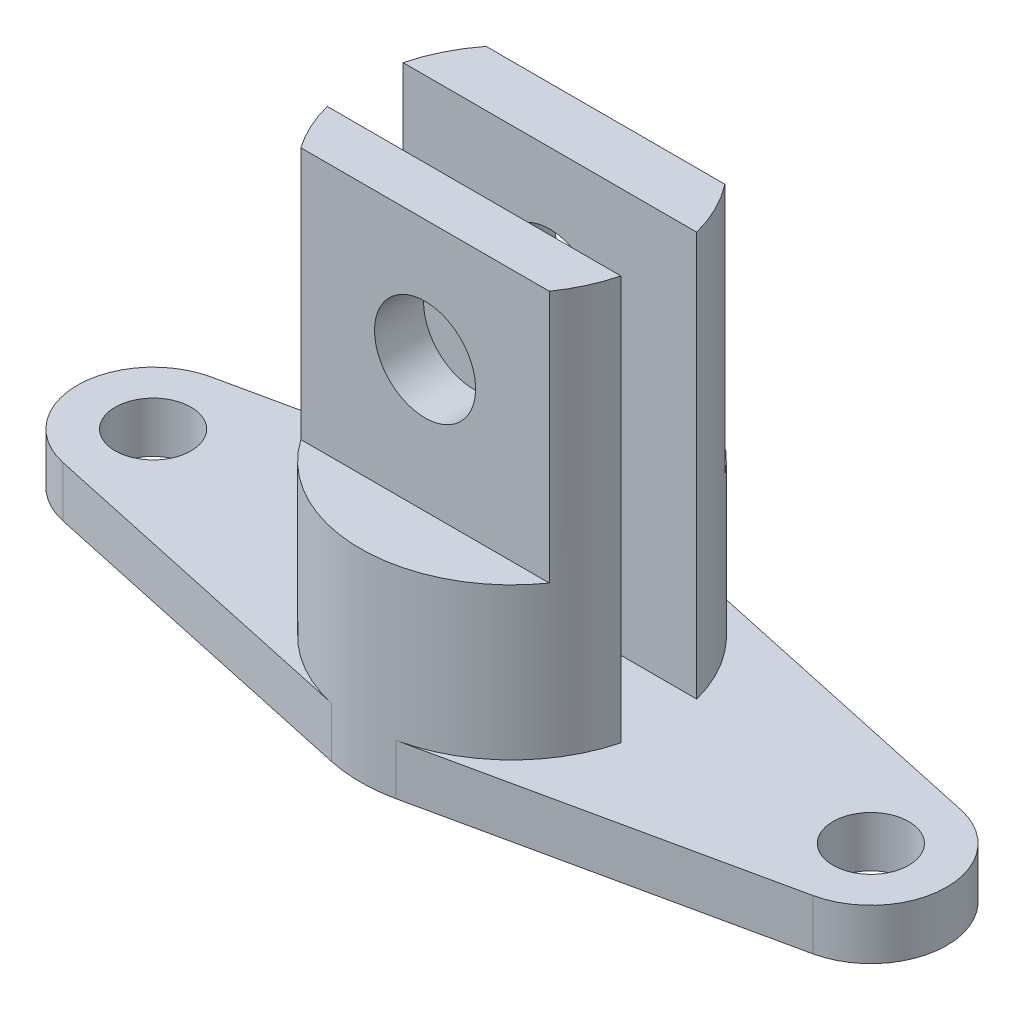
ISO-10303-21;
HEADER;
FILE_DESCRIPTION(('STEP AP214'),'2;1');
FILE_NAME('part.step','',(''),(''),'','','');
FILE_SCHEMA(('AUTOMOTIVE_DESIGN { 1 0 10303 214 1 1 1 1 }'));
ENDSEC;
DATA;
#1=APPLICATION_CONTEXT('core data for automotive mechanical design processes');
#2=APPLICATION_PROTOCOL_DEFINITION('international standard','automotive_design',2000,#1);
#3=PRODUCT_CONTEXT('',#1,'mechanical');
#4=PRODUCT('Part','Part','',(#3));
#5=PRODUCT_RELATED_PRODUCT_CATEGORY('part','',(#4));
#6=PRODUCT_DEFINITION_FORMATION('','',#4);
#7=PRODUCT_DEFINITION_CONTEXT('part definition',#1,'design');
#8=PRODUCT_DEFINITION('design','',#6,#7);
#9=PRODUCT_DEFINITION_SHAPE('','',#8);
#10=(LENGTH_UNIT() NAMED_UNIT(*) SI_UNIT(.MILLI.,.METRE.));
#11=(NAMED_UNIT(*) PLANE_ANGLE_UNIT() SI_UNIT($,.RADIAN.));
#12=(NAMED_UNIT(*) SI_UNIT($,.STERADIAN.) SOLID_ANGLE_UNIT());
#13=UNCERTAINTY_MEASURE_WITH_UNIT(LENGTH_MEASURE(1.E-05),#10,'distance_accuracy_value','');
#14=(GEOMETRIC_REPRESENTATION_CONTEXT(3) GLOBAL_UNCERTAINTY_ASSIGNED_CONTEXT((#13)) GLOBAL_UNIT_ASSIGNED_CONTEXT((#10,
#11,#12)) REPRESENTATION_CONTEXT('',''));
#15=CARTESIAN_POINT('',(0.,0.,0.));
#16=DIRECTION('',(0.,0.,1.));
#17=DIRECTION('',(1.,0.,0.));
#18=AXIS2_PLACEMENT_3D('',#15,#16,#17);
#19=CARTESIAN_POINT('',(6.33802816901409,10.,-29.3228477288408));
#20=DIRECTION('',(-0.211267605633803,0.,0.977428257628027));
#21=DIRECTION('',(0.977428257628027,0.,0.211267605633803));
#22=AXIS2_PLACEMENT_3D('',#19,#20,#21);
#23=PLANE('',#22);
#24=DIRECTION('',(-0.977428257628027,0.,-0.211267605633803));
#25=VECTOR('',#24,1.);
#26=CARTESIAN_POINT('',(6.33802816901409,0.,-29.3228477288408));
#27=LINE('',#26,#25);
#28=CARTESIAN_POINT('',(74.169014084507,0.,-14.6614238644204));
#29=VERTEX_POINT('',#28);
#30=CARTESIAN_POINT('',(6.33802816901409,0.,-29.3228477288408));
#31=VERTEX_POINT('',#30);
#32=EDGE_CURVE('E253',#29,#31,#27,.T.);
#33=ORIENTED_EDGE('',*,*,#32,.T.);
#34=DIRECTION('',(0.,-1.,0.));
#35=VECTOR('',#34,1.);
#36=CARTESIAN_POINT('',(6.33802816901409,10.,-29.3228477288408));
#37=LINE('',#36,#35);
#38=CARTESIAN_POINT('',(6.33802816901409,10.,-29.3228477288408));
#39=VERTEX_POINT('',#38);
#40=EDGE_CURVE('E344',#39,#31,#37,.T.);
#41=ORIENTED_EDGE('',*,*,#40,.F.);
#42=DIRECTION('',(-0.977428257628027,0.,-0.211267605633803));
#43=VECTOR('',#42,1.);
#44=CARTESIAN_POINT('',(6.33802816901409,10.,-29.3228477288408));
#45=LINE('',#44,#43);
#46=CARTESIAN_POINT('',(74.169014084507,10.,-14.6614238644204));
#47=VERTEX_POINT('',#46);
#48=EDGE_CURVE('E254',#47,#39,#45,.T.);
#49=ORIENTED_EDGE('',*,*,#48,.F.);
#50=DIRECTION('',(0.,-1.,0.));
#51=VECTOR('',#50,1.);
#52=CARTESIAN_POINT('',(74.169014084507,10.,-14.6614238644204));
#53=LINE('',#52,#51);
#54=EDGE_CURVE('E285',#47,#29,#53,.T.);
#55=ORIENTED_EDGE('',*,*,#54,.T.);
#56=EDGE_LOOP('',(#33,#41,#49,#55));
#57=FACE_BOUND('',#56,.T.);
#58=ADVANCED_FACE('F43',(#57),#23,.F.);
#59=CARTESIAN_POINT('',(0.,10.,0.));
#60=DIRECTION('',(0.,-1.,0.));
#61=DIRECTION('',(0.,0.,-1.));
#62=AXIS2_PLACEMENT_3D('',#59,#60,#61);
#63=CYLINDRICAL_SURFACE('',#62,30.);
#64=CARTESIAN_POINT('',(0.,90.,0.));
#65=DIRECTION('',(0.,1.,0.));
#66=DIRECTION('',(0.,0.,1.));
#67=AXIS2_PLACEMENT_3D('',#64,#65,#66);
#68=CIRCLE('',#67,30.);
#69=CARTESIAN_POINT('',(-23.6167313572391,90.,-18.5));
#70=VERTEX_POINT('',#69);
#71=CARTESIAN_POINT('',(-29.0473750965556,90.,-7.5));
#72=VERTEX_POINT('',#71);
#73=EDGE_CURVE('E214',#70,#72,#68,.T.);
#74=ORIENTED_EDGE('',*,*,#73,.F.);
#75=DIRECTION('',(0.,1.,0.));
#76=VECTOR('',#75,1.);
#77=CARTESIAN_POINT('',(-23.6167313572391,40.,-18.5));
#78=LINE('',#77,#76);
#79=CARTESIAN_POINT('',(-23.6167313572391,40.,-18.5));
#80=VERTEX_POINT('',#79);
#81=EDGE_CURVE('E67',#80,#70,#78,.T.);
#82=ORIENTED_EDGE('',*,*,#81,.F.);
#83=CARTESIAN_POINT('',(0.,40.,0.));
#84=DIRECTION('',(0.,1.,0.));
#85=DIRECTION('',(0.,0.,1.));
#86=AXIS2_PLACEMENT_3D('',#83,#84,#85);
#87=CIRCLE('',#86,30.);
#88=CARTESIAN_POINT('',(23.6167313572391,40.,-18.5));
#89=VERTEX_POINT('',#88);
#90=EDGE_CURVE('E194',#89,#80,#87,.T.);
#91=ORIENTED_EDGE('',*,*,#90,.F.);
#92=DIRECTION('',(0.,1.,0.));
#93=VECTOR('',#92,1.);
#94=CARTESIAN_POINT('',(23.6167313572391,40.,-18.5));
#95=LINE('',#94,#93);
#96=CARTESIAN_POINT('',(23.6167313572391,90.,-18.5));
#97=VERTEX_POINT('',#96);
#98=EDGE_CURVE('E203',#89,#97,#95,.T.);
#99=ORIENTED_EDGE('',*,*,#98,.T.);
#100=CARTESIAN_POINT('',(29.0473750965556,90.,-7.5));
#101=VERTEX_POINT('',#100);
#102=EDGE_CURVE('E216',#101,#97,#68,.T.);
#103=ORIENTED_EDGE('',*,*,#102,.F.);
#104=DIRECTION('',(0.,-1.,0.));
#105=VECTOR('',#104,1.);
#106=CARTESIAN_POINT('',(29.0473750965556,90.,-7.5));
#107=LINE('',#106,#105);
#108=CARTESIAN_POINT('',(29.0473750965556,9.99999999999999,-7.5));
#109=VERTEX_POINT('',#108);
#110=EDGE_CURVE('E228',#101,#109,#107,.T.);
#111=ORIENTED_EDGE('',*,*,#110,.T.);
#112=CARTESIAN_POINT('',(0.,10.,0.));
#113=DIRECTION('',(0.,1.,0.));
#114=DIRECTION('',(0.,0.,1.));
#115=AXIS2_PLACEMENT_3D('',#112,#113,#114);
#116=CIRCLE('',#115,30.);
#117=EDGE_CURVE('E215',#109,#39,#116,.T.);
#118=ORIENTED_EDGE('',*,*,#117,.T.);
#119=ORIENTED_EDGE('',*,*,#40,.T.);
#120=CARTESIAN_POINT('',(0.,0.,0.));
#121=DIRECTION('',(0.,1.,0.));
#122=DIRECTION('',(0.,0.,1.));
#123=AXIS2_PLACEMENT_3D('',#120,#121,#122);
#124=CIRCLE('',#123,30.);
#125=CARTESIAN_POINT('',(-6.33802816901409,0.,-29.3228477288408));
#126=VERTEX_POINT('',#125);
#127=EDGE_CURVE('E289',#31,#126,#124,.T.);
#128=ORIENTED_EDGE('',*,*,#127,.T.);
#129=DIRECTION('',(0.,-1.,0.));
#130=VECTOR('',#129,1.);
#131=CARTESIAN_POINT('',(-6.33802816901409,10.,-29.3228477288408));
#132=LINE('',#131,#130);
#133=CARTESIAN_POINT('',(-6.33802816901409,10.,-29.3228477288408));
#134=VERTEX_POINT('',#133);
#135=EDGE_CURVE('E341',#134,#126,#132,.T.);
#136=ORIENTED_EDGE('',*,*,#135,.F.);
#137=CARTESIAN_POINT('',(0.,9.99999999999999,0.));
#138=DIRECTION('',(0.,1.,0.));
#139=DIRECTION('',(0.,0.,1.));
#140=AXIS2_PLACEMENT_3D('',#137,#138,#139);
#141=CIRCLE('',#140,30.);
#142=CARTESIAN_POINT('',(-29.0473750965556,10.,-7.5));
#143=VERTEX_POINT('',#142);
#144=EDGE_CURVE('E11',#143,#134,#141,.F.);
#145=ORIENTED_EDGE('',*,*,#144,.F.);
#146=DIRECTION('',(0.,-1.,0.));
#147=VECTOR('',#146,1.);
#148=CARTESIAN_POINT('',(-29.0473750965556,90.,-7.5));
#149=LINE('',#148,#147);
#150=EDGE_CURVE('E220',#72,#143,#149,.T.);
#151=ORIENTED_EDGE('',*,*,#150,.F.);
#152=EDGE_LOOP('',(#74,#82,#91,#99,#103,#111,#118,#119,#128,#136,#145,#151));
#153=FACE_BOUND('',#152,.T.);
#154=ADVANCED_FACE('F383',(#153),#63,.T.);
#155=CARTESIAN_POINT('',(-6.33802816901409,10.,-29.3228477288408));
#156=DIRECTION('',(-0.211267605633803,0.,-0.977428257628027));
#157=DIRECTION('',(-0.977428257628027,0.,0.211267605633803));
#158=AXIS2_PLACEMENT_3D('',#155,#156,#157);
#159=PLANE('',#158);
#160=DIRECTION('',(0.977428257628027,0.,-0.211267605633803));
#161=VECTOR('',#160,1.);
#162=CARTESIAN_POINT('',(-6.33802816901409,0.,-29.3228477288408));
#163=LINE('',#162,#161);
#164=CARTESIAN_POINT('',(-74.169014084507,0.,-14.6614238644204));
#165=VERTEX_POINT('',#164);
#166=EDGE_CURVE('E293',#165,#126,#163,.T.);
#167=ORIENTED_EDGE('',*,*,#166,.F.);
#168=DIRECTION('',(0.,-1.,0.));
#169=VECTOR('',#168,1.);
#170=CARTESIAN_POINT('',(-74.169014084507,10.,-14.6614238644204));
#171=LINE('',#170,#169);
#172=CARTESIAN_POINT('',(-74.169014084507,10.,-14.6614238644204));
#173=VERTEX_POINT('',#172);
#174=EDGE_CURVE('E338',#173,#165,#171,.T.);
#175=ORIENTED_EDGE('',*,*,#174,.F.);
#176=DIRECTION('',(0.977428257628027,0.,-0.211267605633803));
#177=VECTOR('',#176,1.);
#178=CARTESIAN_POINT('',(-6.33802816901409,10.,-29.3228477288408));
#179=LINE('',#178,#177);
#180=EDGE_CURVE('E258',#173,#134,#179,.T.);
#181=ORIENTED_EDGE('',*,*,#180,.T.);
#182=ORIENTED_EDGE('',*,*,#135,.T.);
#183=EDGE_LOOP('',(#167,#175,#181,#182));
#184=FACE_BOUND('',#183,.T.);
#185=ADVANCED_FACE('F388',(#184),#159,.T.);
#186=CARTESIAN_POINT('',(-71.,10.,0.));
#187=DIRECTION('',(0.,-1.,0.));
#188=DIRECTION('',(0.,0.,-1.));
#189=AXIS2_PLACEMENT_3D('',#186,#187,#188);
#190=CYLINDRICAL_SURFACE('',#189,15.);
#191=CARTESIAN_POINT('',(-71.,0.,0.));
#192=DIRECTION('',(0.,1.,0.));
#193=DIRECTION('',(0.,0.,1.));
#194=AXIS2_PLACEMENT_3D('',#191,#192,#193);
#195=CIRCLE('',#194,15.);
#196=CARTESIAN_POINT('',(-74.169014084507,0.,14.6614238644204));
#197=VERTEX_POINT('',#196);
#198=EDGE_CURVE('E297',#165,#197,#195,.T.);
#199=ORIENTED_EDGE('',*,*,#198,.T.);
#200=DIRECTION('',(0.,-1.,0.));
#201=VECTOR('',#200,1.);
#202=CARTESIAN_POINT('',(-74.169014084507,10.,14.6614238644204));
#203=LINE('',#202,#201);
#204=CARTESIAN_POINT('',(-74.169014084507,10.,14.6614238644204));
#205=VERTEX_POINT('',#204);
#206=EDGE_CURVE('E334',#205,#197,#203,.T.);
#207=ORIENTED_EDGE('',*,*,#206,.F.);
#208=CARTESIAN_POINT('',(-71.,10.,0.));
#209=DIRECTION('',(0.,1.,0.));
#210=DIRECTION('',(0.,0.,1.));
#211=AXIS2_PLACEMENT_3D('',#208,#209,#210);
#212=CIRCLE('',#211,15.);
#213=EDGE_CURVE('E263',#173,#205,#212,.T.);
#214=ORIENTED_EDGE('',*,*,#213,.F.);
#215=ORIENTED_EDGE('',*,*,#174,.T.);
#216=EDGE_LOOP('',(#199,#207,#214,#215));
#217=FACE_BOUND('',#216,.T.);
#218=ADVANCED_FACE('F461',(#217),#190,.T.);
#219=CARTESIAN_POINT('',(-6.33802816901408,10.,29.3228477288408));
#220=DIRECTION('',(0.211267605633803,0.,-0.977428257628027));
#221=DIRECTION('',(-0.977428257628027,0.,-0.211267605633803));
#222=AXIS2_PLACEMENT_3D('',#219,#220,#221);
#223=PLANE('',#222);
#224=DIRECTION('',(0.977428257628027,0.,0.211267605633803));
#225=VECTOR('',#224,1.);
#226=CARTESIAN_POINT('',(-6.33802816901408,0.,29.3228477288408));
#227=LINE('',#226,#225);
#228=CARTESIAN_POINT('',(-6.33802816901409,0.,29.3228477288408));
#229=VERTEX_POINT('',#228);
#230=EDGE_CURVE('E300',#197,#229,#227,.T.);
#231=ORIENTED_EDGE('',*,*,#230,.T.);
#232=DIRECTION('',(0.,-1.,0.));
#233=VECTOR('',#232,1.);
#234=CARTESIAN_POINT('',(-6.33802816901409,10.,29.3228477288408));
#235=LINE('',#234,#233);
#236=CARTESIAN_POINT('',(-6.33802816901408,10.,29.3228477288408));
#237=VERTEX_POINT('',#236);
#238=EDGE_CURVE('E330',#237,#229,#235,.T.);
#239=ORIENTED_EDGE('',*,*,#238,.F.);
#240=DIRECTION('',(0.977428257628027,0.,0.211267605633803));
#241=VECTOR('',#240,1.);
#242=CARTESIAN_POINT('',(-6.33802816901408,10.,29.3228477288408));
#243=LINE('',#242,#241);
#244=EDGE_CURVE('E266',#205,#237,#243,.T.);
#245=ORIENTED_EDGE('',*,*,#244,.F.);
#246=ORIENTED_EDGE('',*,*,#206,.T.);
#247=EDGE_LOOP('',(#231,#239,#245,#246));
#248=FACE_BOUND('',#247,.T.);
#249=ADVANCED_FACE('F458',(#248),#223,.F.);
#250=CARTESIAN_POINT('',(0.,10.,0.));
#251=DIRECTION('',(0.,-1.,0.));
#252=DIRECTION('',(0.,0.,-1.));
#253=AXIS2_PLACEMENT_3D('',#250,#251,#252);
#254=CYLINDRICAL_SURFACE('',#253,30.);
#255=CARTESIAN_POINT('',(0.,90.,0.));
#256=DIRECTION('',(0.,1.,0.));
#257=DIRECTION('',(0.,0.,1.));
#258=AXIS2_PLACEMENT_3D('',#255,#256,#257);
#259=CIRCLE('',#258,30.);
#260=CARTESIAN_POINT('',(24.5793181798993,90.,17.2004976035948));
#261=VERTEX_POINT('',#260);
#262=CARTESIAN_POINT('',(29.0473750965556,90.,7.5));
#263=VERTEX_POINT('',#262);
#264=EDGE_CURVE('E174',#261,#263,#259,.T.);
#265=ORIENTED_EDGE('',*,*,#264,.F.);
#266=DIRECTION('',(0.,1.,0.));
#267=VECTOR('',#266,1.);
#268=CARTESIAN_POINT('',(24.5793181798993,40.,17.2004976035948));
#269=LINE('',#268,#267);
#270=CARTESIAN_POINT('',(24.5793181798993,40.,17.2004976035948));
#271=VERTEX_POINT('',#270);
#272=EDGE_CURVE('E59',#271,#261,#269,.T.);
#273=ORIENTED_EDGE('',*,*,#272,.F.);
#274=CARTESIAN_POINT('',(0.,40.,0.));
#275=DIRECTION('',(0.,1.,0.));
#276=DIRECTION('',(0.,0.,1.));
#277=AXIS2_PLACEMENT_3D('',#274,#275,#276);
#278=CIRCLE('',#277,30.);
#279=CARTESIAN_POINT('',(-24.5793181798993,40.,17.2004976035948));
#280=VERTEX_POINT('',#279);
#281=EDGE_CURVE('E158',#280,#271,#278,.T.);
#282=ORIENTED_EDGE('',*,*,#281,.F.);
#283=DIRECTION('',(0.,1.,0.));
#284=VECTOR('',#283,1.);
#285=CARTESIAN_POINT('',(-24.5793181798993,40.,17.2004976035948));
#286=LINE('',#285,#284);
#287=CARTESIAN_POINT('',(-24.5793181798993,90.,17.2004976035948));
#288=VERTEX_POINT('',#287);
#289=EDGE_CURVE('E168',#280,#288,#286,.T.);
#290=ORIENTED_EDGE('',*,*,#289,.T.);
#291=CARTESIAN_POINT('',(-29.0473750965556,90.,7.5));
#292=VERTEX_POINT('',#291);
#293=EDGE_CURVE('E233',#292,#288,#259,.T.);
#294=ORIENTED_EDGE('',*,*,#293,.F.);
#295=DIRECTION('',(0.,-1.,0.));
#296=VECTOR('',#295,1.);
#297=CARTESIAN_POINT('',(-29.0473750965556,90.,7.5));
#298=LINE('',#297,#296);
#299=CARTESIAN_POINT('',(-29.0473750965556,10.,7.5));
#300=VERTEX_POINT('',#299);
#301=EDGE_CURVE('E241',#292,#300,#298,.T.);
#302=ORIENTED_EDGE('',*,*,#301,.T.);
#303=CARTESIAN_POINT('',(0.,10.,0.));
#304=DIRECTION('',(0.,1.,0.));
#305=DIRECTION('',(0.,0.,1.));
#306=AXIS2_PLACEMENT_3D('',#303,#304,#305);
#307=CIRCLE('',#306,30.);
#308=EDGE_CURVE('E232',#300,#237,#307,.T.);
#309=ORIENTED_EDGE('',*,*,#308,.T.);
#310=ORIENTED_EDGE('',*,*,#238,.T.);
#311=CARTESIAN_POINT('',(0.,0.,0.));
#312=DIRECTION('',(0.,1.,0.));
#313=DIRECTION('',(0.,0.,1.));
#314=AXIS2_PLACEMENT_3D('',#311,#312,#313);
#315=CIRCLE('',#314,30.);
#316=CARTESIAN_POINT('',(6.33802816901409,0.,29.3228477288408));
#317=VERTEX_POINT('',#316);
#318=EDGE_CURVE('E303',#229,#317,#315,.T.);
#319=ORIENTED_EDGE('',*,*,#318,.T.);
#320=DIRECTION('',(0.,-1.,0.));
#321=VECTOR('',#320,1.);
#322=CARTESIAN_POINT('',(6.33802816901409,10.,29.3228477288408));
#323=LINE('',#322,#321);
#324=CARTESIAN_POINT('',(6.33802816901408,10.,29.3228477288408));
#325=VERTEX_POINT('',#324);
#326=EDGE_CURVE('E327',#325,#317,#323,.T.);
#327=ORIENTED_EDGE('',*,*,#326,.F.);
#328=CARTESIAN_POINT('',(29.0473750965556,10.,7.5));
#329=VERTEX_POINT('',#328);
#330=EDGE_CURVE('E52',#325,#329,#307,.T.);
#331=ORIENTED_EDGE('',*,*,#330,.T.);
#332=DIRECTION('',(0.,-1.,0.));
#333=VECTOR('',#332,1.);
#334=CARTESIAN_POINT('',(29.0473750965556,90.,7.5));
#335=LINE('',#334,#333);
#336=EDGE_CURVE('E250',#263,#329,#335,.T.);
#337=ORIENTED_EDGE('',*,*,#336,.F.);
#338=EDGE_LOOP('',(#265,#273,#282,#290,#294,#302,#309,#310,#319,#327,#331,#337));
#339=FACE_BOUND('',#338,.T.);
#340=ADVANCED_FACE('F172',(#339),#254,.T.);
#341=CARTESIAN_POINT('',(6.33802816901408,10.,29.3228477288408));
#342=DIRECTION('',(0.211267605633803,0.,0.977428257628027));
#343=DIRECTION('',(0.977428257628027,0.,-0.211267605633803));
#344=AXIS2_PLACEMENT_3D('',#341,#342,#343);
#345=PLANE('',#344);
#346=DIRECTION('',(-0.977428257628027,0.,0.211267605633803));
#347=VECTOR('',#346,1.);
#348=CARTESIAN_POINT('',(6.33802816901408,0.,29.3228477288408));
#349=LINE('',#348,#347);
#350=CARTESIAN_POINT('',(74.169014084507,0.,14.6614238644204));
#351=VERTEX_POINT('',#350);
#352=EDGE_CURVE('E307',#351,#317,#349,.T.);
#353=ORIENTED_EDGE('',*,*,#352,.F.);
#354=DIRECTION('',(0.,-1.,0.));
#355=VECTOR('',#354,1.);
#356=CARTESIAN_POINT('',(74.169014084507,10.,14.6614238644204));
#357=LINE('',#356,#355);
#358=CARTESIAN_POINT('',(74.169014084507,10.,14.6614238644204));
#359=VERTEX_POINT('',#358);
#360=EDGE_CURVE('E324',#359,#351,#357,.T.);
#361=ORIENTED_EDGE('',*,*,#360,.F.);
#362=DIRECTION('',(-0.977428257628027,0.,0.211267605633803));
#363=VECTOR('',#362,1.);
#364=CARTESIAN_POINT('',(6.33802816901408,10.,29.3228477288408));
#365=LINE('',#364,#363);
#366=EDGE_CURVE('E270',#359,#325,#365,.T.);
#367=ORIENTED_EDGE('',*,*,#366,.T.);
#368=ORIENTED_EDGE('',*,*,#326,.T.);
#369=EDGE_LOOP('',(#353,#361,#367,#368));
#370=FACE_BOUND('',#369,.T.);
#371=ADVANCED_FACE('F448',(#370),#345,.T.);
#372=CARTESIAN_POINT('',(71.,10.,0.));
#373=DIRECTION('',(0.,-1.,0.));
#374=DIRECTION('',(0.,0.,-1.));
#375=AXIS2_PLACEMENT_3D('',#372,#373,#374);
#376=CYLINDRICAL_SURFACE('',#375,7.5);
#377=CARTESIAN_POINT('',(71.,10.,0.));
#378=DIRECTION('',(0.,1.,0.));
#379=DIRECTION('',(0.,0.,1.));
#380=AXIS2_PLACEMENT_3D('',#377,#378,#379);
#381=CIRCLE('',#380,7.5);
#382=CARTESIAN_POINT('',(71.,10.,7.49999999999997));
#383=VERTEX_POINT('',#382);
#384=EDGE_CURVE('E277',#383,#383,#381,.T.);
#385=ORIENTED_EDGE('',*,*,#384,.T.);
#386=EDGE_LOOP('',(#385));
#387=FACE_BOUND('',#386,.T.);
#388=CARTESIAN_POINT('',(71.,0.,0.));
#389=DIRECTION('',(0.,1.,0.));
#390=DIRECTION('',(0.,0.,1.));
#391=AXIS2_PLACEMENT_3D('',#388,#389,#390);
#392=CIRCLE('',#391,7.5);
#393=CARTESIAN_POINT('',(71.,0.,7.49999999999997));
#394=VERTEX_POINT('',#393);
#395=EDGE_CURVE('E314',#394,#394,#392,.T.);
#396=ORIENTED_EDGE('',*,*,#395,.F.);
#397=EDGE_LOOP('',(#396));
#398=FACE_BOUND('',#397,.T.);
#399=ADVANCED_FACE('F445',(#387,#398),#376,.F.);
#400=CARTESIAN_POINT('',(71.,10.,0.));
#401=DIRECTION('',(0.,-1.,0.));
#402=DIRECTION('',(0.,0.,-1.));
#403=AXIS2_PLACEMENT_3D('',#400,#401,#402);
#404=CYLINDRICAL_SURFACE('',#403,15.);
#405=CARTESIAN_POINT('',(71.,0.,0.));
#406=DIRECTION('',(0.,1.,0.));
#407=DIRECTION('',(0.,0.,1.));
#408=AXIS2_PLACEMENT_3D('',#405,#406,#407);
#409=CIRCLE('',#408,15.);
#410=EDGE_CURVE('E311',#351,#29,#409,.T.);
#411=ORIENTED_EDGE('',*,*,#410,.T.);
#412=ORIENTED_EDGE('',*,*,#54,.F.);
#413=CARTESIAN_POINT('',(71.,10.,0.));
#414=DIRECTION('',(0.,1.,0.));
#415=DIRECTION('',(0.,0.,1.));
#416=AXIS2_PLACEMENT_3D('',#413,#414,#415);
#417=CIRCLE('',#416,15.);
#418=EDGE_CURVE('E274',#359,#47,#417,.T.);
#419=ORIENTED_EDGE('',*,*,#418,.F.);
#420=ORIENTED_EDGE('',*,*,#360,.T.);
#421=EDGE_LOOP('',(#411,#412,#419,#420));
#422=FACE_BOUND('',#421,.T.);
#423=ADVANCED_FACE('F443',(#422),#404,.T.);
#424=CARTESIAN_POINT('',(-71.,10.,0.));
#425=DIRECTION('',(0.,-1.,0.));
#426=DIRECTION('',(0.,0.,-1.));
#427=AXIS2_PLACEMENT_3D('',#424,#425,#426);
#428=CYLINDRICAL_SURFACE('',#427,7.5);
#429=CARTESIAN_POINT('',(-71.,10.,0.));
#430=DIRECTION('',(0.,1.,0.));
#431=DIRECTION('',(0.,0.,1.));
#432=AXIS2_PLACEMENT_3D('',#429,#430,#431);
#433=CIRCLE('',#432,7.5);
#434=CARTESIAN_POINT('',(-71.,10.,7.5));
#435=VERTEX_POINT('',#434);
#436=EDGE_CURVE('E281',#435,#435,#433,.T.);
#437=ORIENTED_EDGE('',*,*,#436,.T.);
#438=EDGE_LOOP('',(#437));
#439=FACE_BOUND('',#438,.T.);
#440=CARTESIAN_POINT('',(-71.,0.,0.));
#441=DIRECTION('',(0.,1.,0.));
#442=DIRECTION('',(0.,0.,1.));
#443=AXIS2_PLACEMENT_3D('',#440,#441,#442);
#444=CIRCLE('',#443,7.5);
#445=CARTESIAN_POINT('',(-71.,0.,7.5));
#446=VERTEX_POINT('',#445);
#447=EDGE_CURVE('E259',#446,#446,#444,.T.);
#448=ORIENTED_EDGE('',*,*,#447,.F.);
#449=EDGE_LOOP('',(#448));
#450=FACE_BOUND('',#449,.T.);
#451=ADVANCED_FACE('F438',(#439,#450),#428,.F.);
#452=CARTESIAN_POINT('',(0.,10.,0.));
#453=DIRECTION('',(0.,1.,0.));
#454=DIRECTION('',(0.,0.,1.));
#455=AXIS2_PLACEMENT_3D('',#452,#453,#454);
#456=PLANE('',#455);
#457=DIRECTION('',(1.,0.,0.));
#458=VECTOR('',#457,1.);
#459=CARTESIAN_POINT('',(0.,10.,-7.5));
#460=LINE('',#459,#458);
#461=EDGE_CURVE('E207',#143,#109,#460,.T.);
#462=ORIENTED_EDGE('',*,*,#461,.F.);
#463=ORIENTED_EDGE('',*,*,#144,.T.);
#464=ORIENTED_EDGE('',*,*,#180,.F.);
#465=ORIENTED_EDGE('',*,*,#213,.T.);
#466=ORIENTED_EDGE('',*,*,#244,.T.);
#467=ORIENTED_EDGE('',*,*,#308,.F.);
#468=DIRECTION('',(1.,0.,0.));
#469=VECTOR('',#468,1.);
#470=CARTESIAN_POINT('',(0.,10.,7.5));
#471=LINE('',#470,#469);
#472=EDGE_CURVE('E244',#300,#329,#471,.T.);
#473=ORIENTED_EDGE('',*,*,#472,.T.);
#474=ORIENTED_EDGE('',*,*,#330,.F.);
#475=ORIENTED_EDGE('',*,*,#366,.F.);
#476=ORIENTED_EDGE('',*,*,#418,.T.);
#477=ORIENTED_EDGE('',*,*,#48,.T.);
#478=ORIENTED_EDGE('',*,*,#117,.F.);
#479=EDGE_LOOP('',(#462,#463,#464,#465,#466,#467,#473,#474,#475,#476,#477,#478));
#480=FACE_BOUND('',#479,.T.);
#481=ORIENTED_EDGE('',*,*,#384,.F.);
#482=EDGE_LOOP('',(#481));
#483=FACE_BOUND('',#482,.T.);
#484=ORIENTED_EDGE('',*,*,#436,.F.);
#485=EDGE_LOOP('',(#484));
#486=FACE_BOUND('',#485,.T.);
#487=ADVANCED_FACE('F357',(#480,#483,#486),#456,.T.);
#488=CARTESIAN_POINT('',(0.,0.,0.));
#489=DIRECTION('',(0.,1.,0.));
#490=DIRECTION('',(0.,0.,1.));
#491=AXIS2_PLACEMENT_3D('',#488,#489,#490);
#492=PLANE('',#491);
#493=ORIENTED_EDGE('',*,*,#32,.F.);
#494=ORIENTED_EDGE('',*,*,#410,.F.);
#495=ORIENTED_EDGE('',*,*,#352,.T.);
#496=ORIENTED_EDGE('',*,*,#318,.F.);
#497=ORIENTED_EDGE('',*,*,#230,.F.);
#498=ORIENTED_EDGE('',*,*,#198,.F.);
#499=ORIENTED_EDGE('',*,*,#166,.T.);
#500=ORIENTED_EDGE('',*,*,#127,.F.);
#501=EDGE_LOOP('',(#493,#494,#495,#496,#497,#498,#499,#500));
#502=FACE_BOUND('',#501,.T.);
#503=ORIENTED_EDGE('',*,*,#395,.T.);
#504=EDGE_LOOP('',(#503));
#505=FACE_BOUND('',#504,.T.);
#506=ORIENTED_EDGE('',*,*,#447,.T.);
#507=EDGE_LOOP('',(#506));
#508=FACE_BOUND('',#507,.T.);
#509=ADVANCED_FACE('F394',(#502,#505,#508),#492,.F.);
#510=CARTESIAN_POINT('',(0.,90.,7.5));
#511=DIRECTION('',(0.,0.,-1.));
#512=DIRECTION('',(-1.,0.,0.));
#513=AXIS2_PLACEMENT_3D('',#510,#511,#512);
#514=PLANE('',#513);
#515=CARTESIAN_POINT('',(0.,66.,7.5));
#516=DIRECTION('',(0.,0.,-1.));
#517=DIRECTION('',(-1.,0.,0.));
#518=AXIS2_PLACEMENT_3D('',#515,#516,#517);
#519=CIRCLE('',#518,10.);
#520=CARTESIAN_POINT('',(-10.,66.,7.5));
#521=VERTEX_POINT('',#520);
#522=EDGE_CURVE('E189',#521,#521,#519,.T.);
#523=ORIENTED_EDGE('',*,*,#522,.F.);
#524=EDGE_LOOP('',(#523));
#525=FACE_BOUND('',#524,.T.);
#526=ORIENTED_EDGE('',*,*,#472,.F.);
#527=ORIENTED_EDGE('',*,*,#301,.F.);
#528=DIRECTION('',(1.,0.,0.));
#529=VECTOR('',#528,1.);
#530=CARTESIAN_POINT('',(0.,90.,7.5));
#531=LINE('',#530,#529);
#532=EDGE_CURVE('E237',#292,#263,#531,.T.);
#533=ORIENTED_EDGE('',*,*,#532,.T.);
#534=ORIENTED_EDGE('',*,*,#336,.T.);
#535=EDGE_LOOP('',(#526,#527,#533,#534));
#536=FACE_BOUND('',#535,.T.);
#537=ADVANCED_FACE('F360',(#525,#536),#514,.T.);
#538=CARTESIAN_POINT('',(0.,90.,0.));
#539=DIRECTION('',(0.,1.,0.));
#540=DIRECTION('',(0.,0.,1.));
#541=AXIS2_PLACEMENT_3D('',#538,#539,#540);
#542=PLANE('',#541);
#543=DIRECTION('',(-1.,0.,0.));
#544=VECTOR('',#543,1.);
#545=CARTESIAN_POINT('',(-24.5793181798993,90.,17.2004976035948));
#546=LINE('',#545,#544);
#547=EDGE_CURVE('E164',#261,#288,#546,.T.);
#548=ORIENTED_EDGE('',*,*,#547,.F.);
#549=ORIENTED_EDGE('',*,*,#264,.T.);
#550=ORIENTED_EDGE('',*,*,#532,.F.);
#551=ORIENTED_EDGE('',*,*,#293,.T.);
#552=EDGE_LOOP('',(#548,#549,#550,#551));
#553=FACE_BOUND('',#552,.T.);
#554=ADVANCED_FACE('F364',(#553),#542,.T.);
#555=CARTESIAN_POINT('',(0.,90.,-7.5));
#556=DIRECTION('',(0.,0.,-1.));
#557=DIRECTION('',(-1.,0.,0.));
#558=AXIS2_PLACEMENT_3D('',#555,#556,#557);
#559=PLANE('',#558);
#560=CARTESIAN_POINT('',(0.,66.,-7.5));
#561=DIRECTION('',(0.,0.,-1.));
#562=DIRECTION('',(-1.,0.,0.));
#563=AXIS2_PLACEMENT_3D('',#560,#561,#562);
#564=CIRCLE('',#563,10.);
#565=CARTESIAN_POINT('',(-10.,66.,-7.5));
#566=VERTEX_POINT('',#565);
#567=EDGE_CURVE('E185',#566,#566,#564,.T.);
#568=ORIENTED_EDGE('',*,*,#567,.T.);
#569=EDGE_LOOP('',(#568));
#570=FACE_BOUND('',#569,.T.);
#571=ORIENTED_EDGE('',*,*,#461,.T.);
#572=ORIENTED_EDGE('',*,*,#110,.F.);
#573=DIRECTION('',(1.,0.,0.));
#574=VECTOR('',#573,1.);
#575=CARTESIAN_POINT('',(0.,90.,-7.5));
#576=LINE('',#575,#574);
#577=EDGE_CURVE('E210',#72,#101,#576,.T.);
#578=ORIENTED_EDGE('',*,*,#577,.F.);
#579=ORIENTED_EDGE('',*,*,#150,.T.);
#580=EDGE_LOOP('',(#571,#572,#578,#579));
#581=FACE_BOUND('',#580,.T.);
#582=ADVANCED_FACE('F409',(#570,#581),#559,.F.);
#583=CARTESIAN_POINT('',(0.,90.,0.));
#584=DIRECTION('',(0.,1.,0.));
#585=DIRECTION('',(0.,0.,1.));
#586=AXIS2_PLACEMENT_3D('',#583,#584,#585);
#587=PLANE('',#586);
#588=DIRECTION('',(1.,0.,0.));
#589=VECTOR('',#588,1.);
#590=CARTESIAN_POINT('',(-23.6167313572391,90.,-18.5));
#591=LINE('',#590,#589);
#592=EDGE_CURVE('E193',#70,#97,#591,.T.);
#593=ORIENTED_EDGE('',*,*,#592,.F.);
#594=ORIENTED_EDGE('',*,*,#73,.T.);
#595=ORIENTED_EDGE('',*,*,#577,.T.);
#596=ORIENTED_EDGE('',*,*,#102,.T.);
#597=EDGE_LOOP('',(#593,#594,#595,#596));
#598=FACE_BOUND('',#597,.T.);
#599=ADVANCED_FACE('F413',(#598),#587,.T.);
#600=CARTESIAN_POINT('',(-23.6167313572391,40.,-18.5));
#601=DIRECTION('',(0.,0.,1.));
#602=DIRECTION('',(1.,0.,0.));
#603=AXIS2_PLACEMENT_3D('',#600,#601,#602);
#604=PLANE('',#603);
#605=CARTESIAN_POINT('',(0.,66.,-18.5));
#606=DIRECTION('',(0.,0.,-1.));
#607=DIRECTION('',(-1.,0.,0.));
#608=AXIS2_PLACEMENT_3D('',#605,#606,#607);
#609=CIRCLE('',#608,10.);
#610=CARTESIAN_POINT('',(-10.,66.,-18.5));
#611=VERTEX_POINT('',#610);
#612=EDGE_CURVE('E181',#611,#611,#609,.T.);
#613=ORIENTED_EDGE('',*,*,#612,.F.);
#614=EDGE_LOOP('',(#613));
#615=FACE_BOUND('',#614,.T.);
#616=ORIENTED_EDGE('',*,*,#592,.T.);
#617=ORIENTED_EDGE('',*,*,#98,.F.);
#618=DIRECTION('',(1.,0.,0.));
#619=VECTOR('',#618,1.);
#620=CARTESIAN_POINT('',(-23.6167313572391,40.,-18.5));
#621=LINE('',#620,#619);
#622=EDGE_CURVE('E197',#80,#89,#621,.T.);
#623=ORIENTED_EDGE('',*,*,#622,.F.);
#624=ORIENTED_EDGE('',*,*,#81,.T.);
#625=EDGE_LOOP('',(#616,#617,#623,#624));
#626=FACE_BOUND('',#625,.T.);
#627=ADVANCED_FACE('F416',(#615,#626),#604,.F.);
#628=CARTESIAN_POINT('',(0.,40.,0.));
#629=DIRECTION('',(0.,1.,0.));
#630=DIRECTION('',(0.,0.,1.));
#631=AXIS2_PLACEMENT_3D('',#628,#629,#630);
#632=PLANE('',#631);
#633=ORIENTED_EDGE('',*,*,#90,.T.);
#634=ORIENTED_EDGE('',*,*,#622,.T.);
#635=EDGE_LOOP('',(#633,#634));
#636=FACE_BOUND('',#635,.T.);
#637=ADVANCED_FACE('F415',(#636),#632,.T.);
#638=CARTESIAN_POINT('',(0.,66.,31.5));
#639=DIRECTION('',(0.,0.,-1.));
#640=DIRECTION('',(-1.,0.,0.));
#641=AXIS2_PLACEMENT_3D('',#638,#639,#640);
#642=CYLINDRICAL_SURFACE('',#641,10.);
#643=ORIENTED_EDGE('',*,*,#612,.T.);
#644=EDGE_LOOP('',(#643));
#645=FACE_BOUND('',#644,.T.);
#646=ORIENTED_EDGE('',*,*,#567,.F.);
#647=EDGE_LOOP('',(#646));
#648=FACE_BOUND('',#647,.T.);
#649=ADVANCED_FACE('F380',(#645,#648),#642,.F.);
#650=CARTESIAN_POINT('',(0.,66.,17.2004976035948));
#651=DIRECTION('',(0.,0.,-1.));
#652=DIRECTION('',(-1.,0.,0.));
#653=AXIS2_PLACEMENT_3D('',#650,#651,#652);
#654=CIRCLE('',#653,10.);
#655=CARTESIAN_POINT('',(-10.,66.,17.2004976035948));
#656=VERTEX_POINT('',#655);
#657=EDGE_CURVE('E46',#656,#656,#654,.F.);
#658=ORIENTED_EDGE('',*,*,#657,.T.);
#659=EDGE_LOOP('',(#658));
#660=FACE_BOUND('',#659,.T.);
#661=ORIENTED_EDGE('',*,*,#522,.T.);
#662=EDGE_LOOP('',(#661));
#663=FACE_BOUND('',#662,.T.);
#664=ADVANCED_FACE('F371',(#660,#663),#642,.F.);
#665=CARTESIAN_POINT('',(-24.5793181798993,40.,17.2004976035948));
#666=DIRECTION('',(0.,0.,-1.));
#667=DIRECTION('',(-1.,0.,0.));
#668=AXIS2_PLACEMENT_3D('',#665,#666,#667);
#669=PLANE('',#668);
#670=ORIENTED_EDGE('',*,*,#547,.T.);
#671=ORIENTED_EDGE('',*,*,#289,.F.);
#672=DIRECTION('',(-1.,0.,0.));
#673=VECTOR('',#672,1.);
#674=CARTESIAN_POINT('',(-24.5793181798993,40.,17.2004976035948));
#675=LINE('',#674,#673);
#676=EDGE_CURVE('E160',#271,#280,#675,.T.);
#677=ORIENTED_EDGE('',*,*,#676,.F.);
#678=ORIENTED_EDGE('',*,*,#272,.T.);
#679=EDGE_LOOP('',(#670,#671,#677,#678));
#680=FACE_BOUND('',#679,.T.);
#681=ORIENTED_EDGE('',*,*,#657,.F.);
#682=EDGE_LOOP('',(#681));
#683=FACE_BOUND('',#682,.T.);
#684=ADVANCED_FACE('F166',(#680,#683),#669,.F.);
#685=CARTESIAN_POINT('',(0.,40.,0.));
#686=DIRECTION('',(0.,1.,0.));
#687=DIRECTION('',(0.,0.,1.));
#688=AXIS2_PLACEMENT_3D('',#685,#686,#687);
#689=PLANE('',#688);
#690=ORIENTED_EDGE('',*,*,#281,.T.);
#691=ORIENTED_EDGE('',*,*,#676,.T.);
#692=EDGE_LOOP('',(#690,#691));
#693=FACE_BOUND('',#692,.T.);
#694=ADVANCED_FACE('F159',(#693),#689,.T.);
#695=CLOSED_SHELL('',(#58,#154,#185,#218,#249,#340,#371,#399,#423,#451,#487,#509,#537,#554,#582,
#599,#627,#637,#649,#664,#684,#694));
#696=MANIFOLD_SOLID_BREP('B2',#695);
#697=ADVANCED_BREP_SHAPE_REPRESENTATION('',(#18,#696),#14);
#698=SHAPE_DEFINITION_REPRESENTATION(#9,#697);
ENDSEC;
END-ISO-10303-21;
